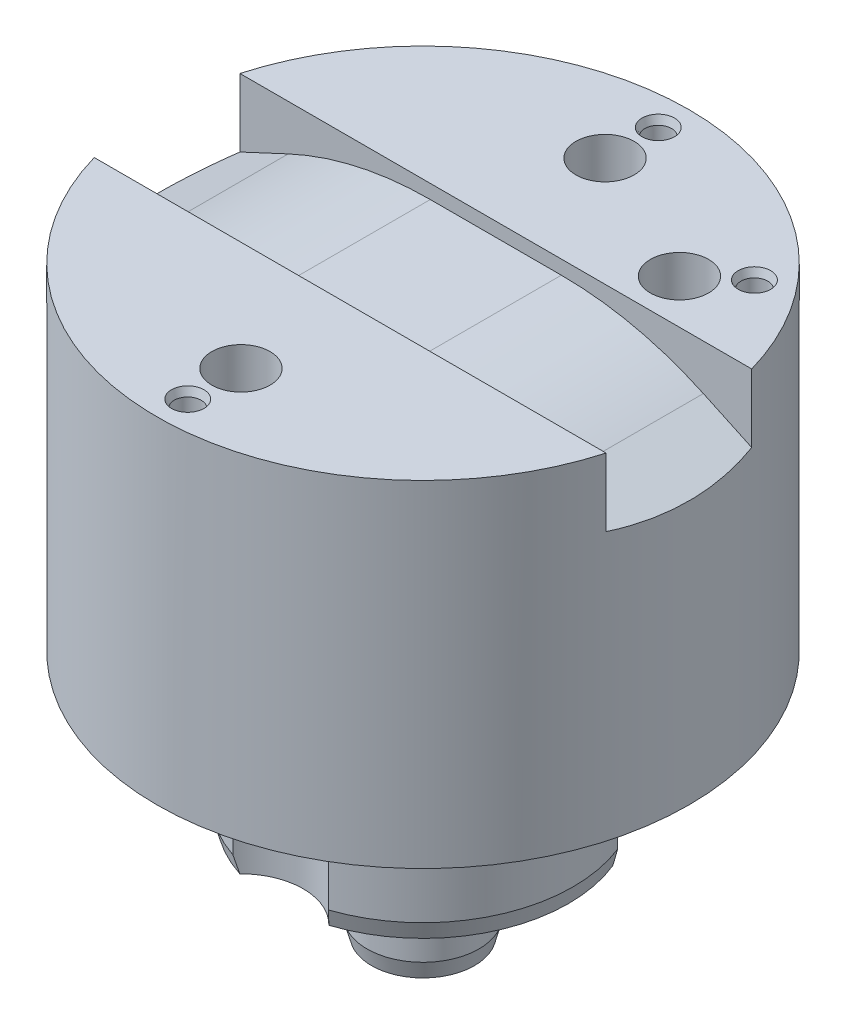
ISO-10303-21;
HEADER;
FILE_DESCRIPTION(('STEP AP214'),'2;1');
FILE_NAME('part.step','',(''),(''),'','','');
FILE_SCHEMA(('AUTOMOTIVE_DESIGN { 1 0 10303 214 1 1 1 1 }'));
ENDSEC;
DATA;
#1=APPLICATION_CONTEXT('core data for automotive mechanical design processes');
#2=APPLICATION_PROTOCOL_DEFINITION('international standard','automotive_design',2000,#1);
#3=PRODUCT_CONTEXT('',#1,'mechanical');
#4=PRODUCT('Part','Part','',(#3));
#5=PRODUCT_RELATED_PRODUCT_CATEGORY('part','',(#4));
#6=PRODUCT_DEFINITION_FORMATION('','',#4);
#7=PRODUCT_DEFINITION_CONTEXT('part definition',#1,'design');
#8=PRODUCT_DEFINITION('design','',#6,#7);
#9=PRODUCT_DEFINITION_SHAPE('','',#8);
#10=(LENGTH_UNIT() NAMED_UNIT(*) SI_UNIT(.MILLI.,.METRE.));
#11=(NAMED_UNIT(*) PLANE_ANGLE_UNIT() SI_UNIT($,.RADIAN.));
#12=(NAMED_UNIT(*) SI_UNIT($,.STERADIAN.) SOLID_ANGLE_UNIT());
#13=UNCERTAINTY_MEASURE_WITH_UNIT(LENGTH_MEASURE(1.E-05),#10,'distance_accuracy_value','');
#14=(GEOMETRIC_REPRESENTATION_CONTEXT(3) GLOBAL_UNCERTAINTY_ASSIGNED_CONTEXT((#13)) GLOBAL_UNIT_ASSIGNED_CONTEXT((#10,
#11,#12)) REPRESENTATION_CONTEXT('',''));
#15=CARTESIAN_POINT('',(0.,0.,0.));
#16=DIRECTION('',(0.,0.,1.));
#17=DIRECTION('',(1.,0.,0.));
#18=AXIS2_PLACEMENT_3D('',#15,#16,#17);
#19=CARTESIAN_POINT('',(23.75,30.,0.));
#20=DIRECTION('',(0.,1.,0.));
#21=DIRECTION('',(0.,0.,1.));
#22=AXIS2_PLACEMENT_3D('',#19,#20,#21);
#23=PLANE('',#22);
#24=CARTESIAN_POINT('',(0.,30.,16.25));
#25=DIRECTION('',(0.,-1.,0.));
#26=DIRECTION('',(0.,0.,-1.));
#27=AXIS2_PLACEMENT_3D('',#24,#25,#26);
#28=CIRCLE('',#27,2.59999999999999);
#29=CARTESIAN_POINT('',(0.,30.,13.65));
#30=VERTEX_POINT('',#29);
#31=EDGE_CURVE('E317',#30,#30,#28,.T.);
#32=ORIENTED_EDGE('',*,*,#31,.T.);
#33=EDGE_LOOP('',(#32));
#34=FACE_BOUND('',#33,.T.);
#35=CARTESIAN_POINT('',(0.,30.,21.));
#36=DIRECTION('',(0.,1.,0.));
#37=DIRECTION('',(0.,0.,1.));
#38=AXIS2_PLACEMENT_3D('',#35,#36,#37);
#39=CIRCLE('',#38,1.45000000000001);
#40=CARTESIAN_POINT('',(0.,30.,22.45));
#41=VERTEX_POINT('',#40);
#42=EDGE_CURVE('E383',#41,#41,#39,.F.);
#43=ORIENTED_EDGE('',*,*,#42,.T.);
#44=EDGE_LOOP('',(#43));
#45=FACE_BOUND('',#44,.T.);
#46=CARTESIAN_POINT('',(0.,30.,0.));
#47=DIRECTION('',(0.,-1.,0.));
#48=DIRECTION('',(0.,0.,-1.));
#49=AXIS2_PLACEMENT_3D('',#46,#47,#48);
#50=CIRCLE('',#49,23.75);
#51=CARTESIAN_POINT('',(22.8432156230247,30.,6.5));
#52=VERTEX_POINT('',#51);
#53=CARTESIAN_POINT('',(-22.8432156230247,30.,6.5));
#54=VERTEX_POINT('',#53);
#55=EDGE_CURVE('E357',#52,#54,#50,.T.);
#56=ORIENTED_EDGE('',*,*,#55,.F.);
#57=DIRECTION('',(-1.,0.,0.));
#58=VECTOR('',#57,1.);
#59=CARTESIAN_POINT('',(-23.75,30.,6.5));
#60=LINE('',#59,#58);
#61=EDGE_CURVE('E163',#52,#54,#60,.T.);
#62=ORIENTED_EDGE('',*,*,#61,.T.);
#63=EDGE_LOOP('',(#56,#62));
#64=FACE_BOUND('',#63,.T.);
#65=ADVANCED_FACE('F35',(#34,#45,#64),#23,.T.);
#66=CARTESIAN_POINT('',(0.,0.,0.));
#67=DIRECTION('',(0.,-1.,0.));
#68=DIRECTION('',(0.,0.,-1.));
#69=AXIS2_PLACEMENT_3D('',#66,#67,#68);
#70=CYLINDRICAL_SURFACE('',#69,23.75);
#71=CARTESIAN_POINT('',(0.,34.5788457269375,0.));
#72=DIRECTION('',(0.422618261740701,-0.906307787036649,0.));
#73=DIRECTION('',(-0.906307787036649,-0.422618261740701,0.));
#74=AXIS2_PLACEMENT_3D('',#71,#72,#73);
#75=ELLIPSE('',#74,26.2052255753592,23.75);
#76=CARTESIAN_POINT('',(-22.8432156230247,23.9268793450351,-6.5));
#77=VERTEX_POINT('',#76);
#78=CARTESIAN_POINT('',(-22.8432156230247,23.9268793450351,6.5));
#79=VERTEX_POINT('',#78);
#80=EDGE_CURVE('E173',#77,#79,#75,.F.);
#81=ORIENTED_EDGE('',*,*,#80,.F.);
#82=DIRECTION('',(0.,-1.,0.));
#83=VECTOR('',#82,1.);
#84=CARTESIAN_POINT('',(-22.8432156230247,0.,-6.5));
#85=LINE('',#84,#83);
#86=CARTESIAN_POINT('',(-22.8432156230247,30.,-6.5));
#87=VERTEX_POINT('',#86);
#88=EDGE_CURVE('E180',#87,#77,#85,.T.);
#89=ORIENTED_EDGE('',*,*,#88,.F.);
#90=CARTESIAN_POINT('',(22.8432156230247,30.,-6.5));
#91=VERTEX_POINT('',#90);
#92=EDGE_CURVE('E355',#87,#91,#50,.T.);
#93=ORIENTED_EDGE('',*,*,#92,.T.);
#94=DIRECTION('',(0.,-1.,0.));
#95=VECTOR('',#94,1.);
#96=CARTESIAN_POINT('',(22.8432156230247,0.,-6.5));
#97=LINE('',#96,#95);
#98=CARTESIAN_POINT('',(22.8432156230247,23.9268793450351,-6.5));
#99=VERTEX_POINT('',#98);
#100=EDGE_CURVE('E178',#99,#91,#97,.F.);
#101=ORIENTED_EDGE('',*,*,#100,.F.);
#102=CARTESIAN_POINT('',(0.,34.5788457269375,0.));
#103=DIRECTION('',(-0.422618261740701,-0.906307787036649,0.));
#104=DIRECTION('',(0.906307787036649,-0.422618261740701,0.));
#105=AXIS2_PLACEMENT_3D('',#102,#103,#104);
#106=ELLIPSE('',#105,26.2052255753592,23.75);
#107=CARTESIAN_POINT('',(22.8432156230247,23.9268793450351,6.5));
#108=VERTEX_POINT('',#107);
#109=EDGE_CURVE('E159',#108,#99,#106,.F.);
#110=ORIENTED_EDGE('',*,*,#109,.F.);
#111=DIRECTION('',(0.,-1.,0.));
#112=VECTOR('',#111,1.);
#113=CARTESIAN_POINT('',(22.8432156230247,0.,6.5));
#114=LINE('',#113,#112);
#115=EDGE_CURVE('E167',#108,#52,#114,.F.);
#116=ORIENTED_EDGE('',*,*,#115,.T.);
#117=ORIENTED_EDGE('',*,*,#55,.T.);
#118=DIRECTION('',(0.,-1.,0.));
#119=VECTOR('',#118,1.);
#120=CARTESIAN_POINT('',(-22.8432156230247,0.,6.5));
#121=LINE('',#120,#119);
#122=EDGE_CURVE('E392',#54,#79,#121,.T.);
#123=ORIENTED_EDGE('',*,*,#122,.T.);
#124=EDGE_LOOP('',(#81,#89,#93,#101,#110,#116,#117,#123));
#125=FACE_BOUND('',#124,.T.);
#126=CARTESIAN_POINT('',(0.,0.,0.));
#127=DIRECTION('',(0.,-1.,0.));
#128=DIRECTION('',(0.,0.,-1.));
#129=AXIS2_PLACEMENT_3D('',#126,#127,#128);
#130=CIRCLE('',#129,23.75);
#131=CARTESIAN_POINT('',(0.,0.,-23.75));
#132=VERTEX_POINT('',#131);
#133=EDGE_CURVE('E352',#132,#132,#130,.T.);
#134=ORIENTED_EDGE('',*,*,#133,.F.);
#135=EDGE_LOOP('',(#134));
#136=FACE_BOUND('',#135,.T.);
#137=ADVANCED_FACE('F175',(#125,#136),#70,.T.);
#138=CARTESIAN_POINT('',(0.,0.,0.));
#139=DIRECTION('',(0.,-1.,0.));
#140=DIRECTION('',(0.,0.,-1.));
#141=AXIS2_PLACEMENT_3D('',#138,#139,#140);
#142=CYLINDRICAL_SURFACE('',#141,13.4);
#143=CARTESIAN_POINT('',(0.,-11.5071796769724,0.));
#144=DIRECTION('',(0.,-1.,0.));
#145=DIRECTION('',(0.,0.,-1.));
#146=AXIS2_PLACEMENT_3D('',#143,#144,#145);
#147=CIRCLE('',#146,13.4);
#148=CARTESIAN_POINT('',(-4.26793716784104,-11.5071796769724,-12.7021538461538));
#149=VERTEX_POINT('',#148);
#150=CARTESIAN_POINT('',(-4.26793716784104,-11.5071796769724,12.7021538461539));
#151=VERTEX_POINT('',#150);
#152=EDGE_CURVE('E370',#149,#151,#147,.F.);
#153=ORIENTED_EDGE('',*,*,#152,.T.);
#154=DIRECTION('',(0.,1.,0.));
#155=VECTOR('',#154,1.);
#156=CARTESIAN_POINT('',(-4.26793716784104,-11.,12.7021538461538));
#157=LINE('',#156,#155);
#158=CARTESIAN_POINT('',(-4.26793716784104,0.,12.7021538461538));
#159=VERTEX_POINT('',#158);
#160=EDGE_CURVE('E261',#151,#159,#157,.T.);
#161=ORIENTED_EDGE('',*,*,#160,.T.);
#162=CARTESIAN_POINT('',(0.,0.,0.));
#163=DIRECTION('',(0.,-1.,0.));
#164=DIRECTION('',(0.,0.,-1.));
#165=AXIS2_PLACEMENT_3D('',#162,#163,#164);
#166=CIRCLE('',#165,13.4);
#167=CARTESIAN_POINT('',(-4.26793716784104,0.,-12.7021538461539));
#168=VERTEX_POINT('',#167);
#169=EDGE_CURVE('E348',#159,#168,#166,.T.);
#170=ORIENTED_EDGE('',*,*,#169,.T.);
#171=DIRECTION('',(0.,1.,0.));
#172=VECTOR('',#171,1.);
#173=CARTESIAN_POINT('',(-4.26793716784104,-11.,-12.7021538461538));
#174=LINE('',#173,#172);
#175=EDGE_CURVE('E283',#168,#149,#174,.F.);
#176=ORIENTED_EDGE('',*,*,#175,.T.);
#177=EDGE_LOOP('',(#153,#161,#170,#176));
#178=FACE_BOUND('',#177,.T.);
#179=ADVANCED_FACE('F405',(#178),#142,.T.);
#180=CARTESIAN_POINT('',(12.4737914998974,0.,-4.89535755763431));
#181=VERTEX_POINT('',#180);
#182=CARTESIAN_POINT('',(4.26793716784104,0.,12.7021538461538));
#183=VERTEX_POINT('',#182);
#184=EDGE_CURVE('E351',#181,#183,#166,.T.);
#185=ORIENTED_EDGE('',*,*,#184,.T.);
#186=DIRECTION('',(0.,1.,0.));
#187=VECTOR('',#186,1.);
#188=CARTESIAN_POINT('',(4.26793716784104,-11.,12.7021538461538));
#189=LINE('',#188,#187);
#190=CARTESIAN_POINT('',(4.26793716784104,-11.5071796769724,12.7021538461538));
#191=VERTEX_POINT('',#190);
#192=EDGE_CURVE('E260',#183,#191,#189,.F.);
#193=ORIENTED_EDGE('',*,*,#192,.T.);
#194=CARTESIAN_POINT('',(12.4737914998974,-11.5071796769724,-4.89535755763431));
#195=VERTEX_POINT('',#194);
#196=EDGE_CURVE('E374',#191,#195,#147,.F.);
#197=ORIENTED_EDGE('',*,*,#196,.T.);
#198=DIRECTION('',(0.,1.,0.));
#199=VECTOR('',#198,1.);
#200=CARTESIAN_POINT('',(12.4737914998974,-11.,-4.89535755763431));
#201=LINE('',#200,#199);
#202=EDGE_CURVE('E296',#195,#181,#201,.T.);
#203=ORIENTED_EDGE('',*,*,#202,.T.);
#204=EDGE_LOOP('',(#185,#193,#197,#203));
#205=FACE_BOUND('',#204,.T.);
#206=ADVANCED_FACE('F473',(#205),#142,.T.);
#207=CARTESIAN_POINT('',(4.26793716784104,0.,-12.7021538461538));
#208=VERTEX_POINT('',#207);
#209=CARTESIAN_POINT('',(6.98703723907965,0.,-11.4342166596455));
#210=VERTEX_POINT('',#209);
#211=EDGE_CURVE('E347',#208,#210,#166,.T.);
#212=ORIENTED_EDGE('',*,*,#211,.T.);
#213=DIRECTION('',(0.,1.,0.));
#214=VECTOR('',#213,1.);
#215=CARTESIAN_POINT('',(6.98703723907965,-11.,-11.4342166596455));
#216=LINE('',#215,#214);
#217=CARTESIAN_POINT('',(6.98703723907965,-11.5071796769724,-11.4342166596455));
#218=VERTEX_POINT('',#217);
#219=EDGE_CURVE('E305',#210,#218,#216,.F.);
#220=ORIENTED_EDGE('',*,*,#219,.T.);
#221=CARTESIAN_POINT('',(4.26793716784105,-11.5071796769724,-12.7021538461538));
#222=VERTEX_POINT('',#221);
#223=EDGE_CURVE('E368',#218,#222,#147,.F.);
#224=ORIENTED_EDGE('',*,*,#223,.T.);
#225=DIRECTION('',(0.,1.,0.));
#226=VECTOR('',#225,1.);
#227=CARTESIAN_POINT('',(4.26793716784104,-11.,-12.7021538461538));
#228=LINE('',#227,#226);
#229=EDGE_CURVE('E274',#222,#208,#228,.T.);
#230=ORIENTED_EDGE('',*,*,#229,.T.);
#231=EDGE_LOOP('',(#212,#220,#224,#230));
#232=FACE_BOUND('',#231,.T.);
#233=ADVANCED_FACE('F461',(#232),#142,.T.);
#234=CARTESIAN_POINT('',(0.,-13.,0.));
#235=DIRECTION('',(0.,1.,0.));
#236=DIRECTION('',(0.,0.,1.));
#237=AXIS2_PLACEMENT_3D('',#234,#235,#236);
#238=CONICAL_SURFACE('',#237,13.,0.26179938779915);
#239=ORIENTED_EDGE('',*,*,#196,.F.);
#240=CARTESIAN_POINT('',(4.26797390257829,-11.5069796769724,12.7021980372475));
#241=CARTESIAN_POINT('',(4.24508339815546,-11.6316042545629,12.6746614907038));
#242=CARTESIAN_POINT('',(4.22183616440305,-11.7561881899293,12.6472368756059));
#243=CARTESIAN_POINT('',(4.17460568750106,-12.0052609722505,12.5926140742735));
#244=CARTESIAN_POINT('',(4.15062247248686,-12.1297498226542,12.5654158794337));
#245=CARTESIAN_POINT('',(4.10189572201431,-12.3786282303866,12.5112463639078));
#246=CARTESIAN_POINT('',(4.07715218605884,-12.5030177876502,12.4842750433702));
#247=CARTESIAN_POINT('',(4.02687601684089,-12.7516916663727,12.430560034923));
#248=CARTESIAN_POINT('',(4.00134335348377,-12.8759759836317,12.4038163557447));
#249=CARTESIAN_POINT('',(3.97540267373374,-13.0002,12.3771878974483));
#250=B_SPLINE_CURVE_WITH_KNOTS('',3,(#240,#241,#242,#243,#244,#245,#246,#247,#248,#249),
.UNSPECIFIED.,.F.,.F.,(4,2,2,2,4),(0.,0.389000554577273,0.777986256768243,1.166972213297,
1.55597302277849),.UNSPECIFIED.);
#251=CARTESIAN_POINT('',(3.97544443870204,-13.,12.3772307692308));
#252=VERTEX_POINT('',#251);
#253=EDGE_CURVE('E253',#191,#252,#250,.T.);
#254=ORIENTED_EDGE('',*,*,#253,.T.);
#255=CARTESIAN_POINT('',(0.,-13.,0.));
#256=DIRECTION('',(0.,-1.,0.));
#257=DIRECTION('',(0.,0.,-1.));
#258=AXIS2_PLACEMENT_3D('',#255,#256,#257);
#259=CIRCLE('',#258,13.);
#260=CARTESIAN_POINT('',(12.0368752801654,-13.,-4.91056345949656));
#261=VERTEX_POINT('',#260);
#262=EDGE_CURVE('E369',#261,#252,#259,.T.);
#263=ORIENTED_EDGE('',*,*,#262,.F.);
#264=CARTESIAN_POINT('',(12.0368155924706,-13.0001999999999,-4.9105678958679));
#265=CARTESIAN_POINT('',(12.0738885225075,-12.8759759836316,-4.9078126253526));
#266=CARTESIAN_POINT('',(12.1107874489789,-12.7516916663726,-4.90544397608309));
#267=CARTESIAN_POINT('',(12.1842524313477,-12.5030177876502,-4.90145753791643));
#268=CARTESIAN_POINT('',(12.2208184999012,-12.3786282303865,-4.89983972035313));
#269=CARTESIAN_POINT('',(12.2936357077202,-12.1297498226542,-4.89733235732513));
#270=CARTESIAN_POINT('',(12.3298868471917,-12.0052609722505,-4.89644281138425));
#271=CARTESIAN_POINT('',(12.4020895059722,-11.7561881899293,-4.89537302691047));
#272=CARTESIAN_POINT('',(12.4380410137881,-11.6316042545629,-4.89519281546188));
#273=CARTESIAN_POINT('',(12.4738489648731,-11.5069796769724,-4.89535782268042));
#274=B_SPLINE_CURVE_WITH_KNOTS('',3,(#264,#265,#266,#267,#268,#269,#270,#271,#272,#273),
.UNSPECIFIED.,.F.,.F.,(4,2,2,2,4),(0.,0.389000809481457,0.777986766010179,1.16697246820112,
1.55597302277836),.UNSPECIFIED.);
#275=EDGE_CURVE('E286',#261,#195,#274,.T.);
#276=ORIENTED_EDGE('',*,*,#275,.T.);
#277=EDGE_LOOP('',(#239,#254,#263,#276));
#278=FACE_BOUND('',#277,.T.);
#279=ADVANCED_FACE('F240',(#278),#238,.T.);
#280=CARTESIAN_POINT('',(-3.97544443870204,-13.,12.3772307692308));
#281=VERTEX_POINT('',#280);
#282=CARTESIAN_POINT('',(-3.97544443870204,-13.,-12.3772307692308));
#283=VERTEX_POINT('',#282);
#284=EDGE_CURVE('E364',#281,#283,#259,.T.);
#285=ORIENTED_EDGE('',*,*,#284,.F.);
#286=CARTESIAN_POINT('',(-3.97540267373374,-13.0002,12.3771878974483));
#287=CARTESIAN_POINT('',(-4.00134335348377,-12.8759759836317,12.4038163557447));
#288=CARTESIAN_POINT('',(-4.02687601684089,-12.7516916663727,12.430560034923));
#289=CARTESIAN_POINT('',(-4.07715218605884,-12.5030177876502,12.4842750433702));
#290=CARTESIAN_POINT('',(-4.10189572201431,-12.3786282303866,12.5112463639078));
#291=CARTESIAN_POINT('',(-4.15062247248686,-12.1297498226542,12.5654158794337));
#292=CARTESIAN_POINT('',(-4.17460568750106,-12.0052609722505,12.5926140742735));
#293=CARTESIAN_POINT('',(-4.22183616440305,-11.7561881899293,12.6472368756059));
#294=CARTESIAN_POINT('',(-4.24508339815545,-11.6316042545629,12.6746614907038));
#295=CARTESIAN_POINT('',(-4.26797390257829,-11.5069796769724,12.7021980372475));
#296=B_SPLINE_CURVE_WITH_KNOTS('',3,(#286,#287,#288,#289,#290,#291,#292,#293,#294,#295),
.UNSPECIFIED.,.F.,.F.,(4,2,2,2,4),(0.,0.389000809481489,0.777986766010243,1.16697246820122,
1.55597302277849),.UNSPECIFIED.);
#297=EDGE_CURVE('E228',#281,#151,#296,.T.);
#298=ORIENTED_EDGE('',*,*,#297,.T.);
#299=ORIENTED_EDGE('',*,*,#152,.F.);
#300=CARTESIAN_POINT('',(-4.26797390257829,-11.5069796769724,-12.7021980372475));
#301=CARTESIAN_POINT('',(-4.24508339815546,-11.6316042545629,-12.6746614907038));
#302=CARTESIAN_POINT('',(-4.22183616440305,-11.7561881899293,-12.6472368756059));
#303=CARTESIAN_POINT('',(-4.17460568750106,-12.0052609722505,-12.5926140742735));
#304=CARTESIAN_POINT('',(-4.15062247248686,-12.1297498226542,-12.5654158794337));
#305=CARTESIAN_POINT('',(-4.10189572201431,-12.3786282303866,-12.5112463639078));
#306=CARTESIAN_POINT('',(-4.07715218605884,-12.5030177876502,-12.4842750433702));
#307=CARTESIAN_POINT('',(-4.02687601684089,-12.7516916663727,-12.430560034923));
#308=CARTESIAN_POINT('',(-4.00134335348377,-12.8759759836317,-12.4038163557447));
#309=CARTESIAN_POINT('',(-3.97540267373374,-13.0002,-12.3771878974483));
#310=B_SPLINE_CURVE_WITH_KNOTS('',3,(#300,#301,#302,#303,#304,#305,#306,#307,#308,#309),
.UNSPECIFIED.,.F.,.F.,(4,2,2,2,4),(0.,0.389000554577273,0.777986256768243,1.166972213297,
1.55597302277849),.UNSPECIFIED.);
#311=EDGE_CURVE('E276',#149,#283,#310,.T.);
#312=ORIENTED_EDGE('',*,*,#311,.T.);
#313=EDGE_LOOP('',(#285,#298,#299,#312));
#314=FACE_BOUND('',#313,.T.);
#315=ADVANCED_FACE('F485',(#314),#238,.T.);
#316=ORIENTED_EDGE('',*,*,#223,.F.);
#317=CARTESIAN_POINT('',(6.98704747878742,-11.5069796769724,-11.4342732055743));
#318=CARTESIAN_POINT('',(6.9806669929474,-11.6316042545629,-11.3990379109291));
#319=CARTESIAN_POINT('',(6.97460155276254,-11.7561881899293,-11.3636012939099));
#320=CARTESIAN_POINT('',(6.96311722468644,-12.0052609722505,-11.2923097896304));
#321=CARTESIAN_POINT('',(6.9576983121181,-12.1297498226542,-11.2564549183918));
#322=CARTESIAN_POINT('',(6.94752300722712,-12.3786282303866,-11.1843085685583));
#323=CARTESIAN_POINT('',(6.94276661533766,-12.5030177876502,-11.148017089678));
#324=CARTESIAN_POINT('',(6.93393543024041,-12.7516916663727,-11.0749759677432));
#325=CARTESIAN_POINT('',(6.92986066306557,-12.8759759836317,-11.0382263072472));
#326=CARTESIAN_POINT('',(6.926136428089,-13.0002,-11.001238150616));
#327=B_SPLINE_CURVE_WITH_KNOTS('',3,(#317,#318,#319,#320,#321,#322,#323,#324,#325,#326),
.UNSPECIFIED.,.F.,.F.,(4,2,2,2,4),(0.,0.389000554577274,0.777986256768244,1.166972213297,
1.55597302277849),.UNSPECIFIED.);
#328=CARTESIAN_POINT('',(6.92614242377555,-13.,-11.0012977018885));
#329=VERTEX_POINT('',#328);
#330=EDGE_CURVE('E298',#218,#329,#327,.T.);
#331=ORIENTED_EDGE('',*,*,#330,.T.);
#332=CARTESIAN_POINT('',(3.97544443870205,-13.,-12.3772307692308));
#333=VERTEX_POINT('',#332);
#334=EDGE_CURVE('E365',#333,#329,#259,.T.);
#335=ORIENTED_EDGE('',*,*,#334,.F.);
#336=CARTESIAN_POINT('',(3.97540267373374,-13.0002,-12.3771878974483));
#337=CARTESIAN_POINT('',(4.00134335348378,-12.8759759836317,-12.4038163557447));
#338=CARTESIAN_POINT('',(4.0268760168409,-12.7516916663727,-12.430560034923));
#339=CARTESIAN_POINT('',(4.07715218605885,-12.5030177876502,-12.4842750433702));
#340=CARTESIAN_POINT('',(4.10189572201431,-12.3786282303866,-12.5112463639078));
#341=CARTESIAN_POINT('',(4.15062247248686,-12.1297498226542,-12.5654158794337));
#342=CARTESIAN_POINT('',(4.17460568750106,-12.0052609722505,-12.5926140742735));
#343=CARTESIAN_POINT('',(4.22183616440305,-11.7561881899293,-12.6472368756059));
#344=CARTESIAN_POINT('',(4.24508339815546,-11.6316042545629,-12.6746614907038));
#345=CARTESIAN_POINT('',(4.2679739025783,-11.5069796769724,-12.7021980372475));
#346=B_SPLINE_CURVE_WITH_KNOTS('',3,(#336,#337,#338,#339,#340,#341,#342,#343,#344,#345),
.UNSPECIFIED.,.F.,.F.,(4,2,2,2,4),(0.,0.389000809481488,0.777986766010245,1.16697246820121,
1.55597302277849),.UNSPECIFIED.);
#347=EDGE_CURVE('E264',#333,#222,#346,.T.);
#348=ORIENTED_EDGE('',*,*,#347,.T.);
#349=EDGE_LOOP('',(#316,#331,#335,#348));
#350=FACE_BOUND('',#349,.T.);
#351=ADVANCED_FACE('F420',(#350),#238,.T.);
#352=CARTESIAN_POINT('',(5.,-22.,0.));
#353=DIRECTION('',(0.,-1.,0.));
#354=DIRECTION('',(0.,0.,-1.));
#355=AXIS2_PLACEMENT_3D('',#352,#353,#354);
#356=PLANE('',#355);
#357=CARTESIAN_POINT('',(0.,-22.,0.));
#358=DIRECTION('',(0.,-1.,0.));
#359=DIRECTION('',(0.,0.,-1.));
#360=AXIS2_PLACEMENT_3D('',#357,#358,#359);
#361=CIRCLE('',#360,4.60000000000002);
#362=CARTESIAN_POINT('',(0.,-22.,-4.60000000000002));
#363=VERTEX_POINT('',#362);
#364=EDGE_CURVE('E358',#363,#363,#361,.T.);
#365=ORIENTED_EDGE('',*,*,#364,.T.);
#366=EDGE_LOOP('',(#365));
#367=FACE_BOUND('',#366,.T.);
#368=ADVANCED_FACE('F411',(#367),#356,.T.);
#369=DIRECTION('',(-1.,0.,0.));
#370=VECTOR('',#369,1.);
#371=CARTESIAN_POINT('',(-23.75,30.,-6.5));
#372=LINE('',#371,#370);
#373=EDGE_CURVE('E205',#91,#87,#372,.T.);
#374=ORIENTED_EDGE('',*,*,#373,.F.);
#375=ORIENTED_EDGE('',*,*,#92,.F.);
#376=EDGE_LOOP('',(#374,#375));
#377=FACE_BOUND('',#376,.T.);
#378=CARTESIAN_POINT('',(16.0869333054986,30.,-13.4985398034173));
#379=DIRECTION('',(0.,1.,0.));
#380=DIRECTION('',(0.,0.,1.));
#381=AXIS2_PLACEMENT_3D('',#378,#379,#380);
#382=CIRCLE('',#381,1.45000000000001);
#383=CARTESIAN_POINT('',(16.0869333054986,30.,-12.0485398034173));
#384=VERTEX_POINT('',#383);
#385=EDGE_CURVE('E380',#384,#384,#382,.F.);
#386=ORIENTED_EDGE('',*,*,#385,.T.);
#387=EDGE_LOOP('',(#386));
#388=FACE_BOUND('',#387,.T.);
#389=CARTESIAN_POINT('',(0.,30.,-21.));
#390=DIRECTION('',(0.,1.,0.));
#391=DIRECTION('',(0.,0.,1.));
#392=AXIS2_PLACEMENT_3D('',#389,#390,#391);
#393=CIRCLE('',#392,1.45000000000001);
#394=CARTESIAN_POINT('',(0.,30.,-19.55));
#395=VERTEX_POINT('',#394);
#396=EDGE_CURVE('E377',#395,#395,#393,.F.);
#397=ORIENTED_EDGE('',*,*,#396,.T.);
#398=EDGE_LOOP('',(#397));
#399=FACE_BOUND('',#398,.T.);
#400=CARTESIAN_POINT('',(0.,30.,-16.25));
#401=DIRECTION('',(0.,-1.,0.));
#402=DIRECTION('',(0.,0.,-1.));
#403=AXIS2_PLACEMENT_3D('',#400,#401,#402);
#404=CIRCLE('',#403,2.59999999999999);
#405=CARTESIAN_POINT('',(0.,30.,-18.85));
#406=VERTEX_POINT('',#405);
#407=EDGE_CURVE('E329',#406,#406,#404,.T.);
#408=ORIENTED_EDGE('',*,*,#407,.T.);
#409=EDGE_LOOP('',(#408));
#410=FACE_BOUND('',#409,.T.);
#411=CARTESIAN_POINT('',(12.4482222006834,30.,-10.4452986574062));
#412=DIRECTION('',(0.,-1.,0.));
#413=DIRECTION('',(0.,0.,-1.));
#414=AXIS2_PLACEMENT_3D('',#411,#412,#413);
#415=CIRCLE('',#414,2.59999999999999);
#416=CARTESIAN_POINT('',(12.4482222006834,30.,-13.0452986574062));
#417=VERTEX_POINT('',#416);
#418=EDGE_CURVE('E341',#417,#417,#415,.T.);
#419=ORIENTED_EDGE('',*,*,#418,.T.);
#420=EDGE_LOOP('',(#419));
#421=FACE_BOUND('',#420,.T.);
#422=ADVANCED_FACE('F401',(#377,#388,#399,#410,#421),#23,.T.);
#423=CARTESIAN_POINT('',(13.4,0.,0.));
#424=DIRECTION('',(0.,-1.,0.));
#425=DIRECTION('',(0.,0.,-1.));
#426=AXIS2_PLACEMENT_3D('',#423,#424,#425);
#427=PLANE('',#426);
#428=CARTESIAN_POINT('',(0.,0.,16.25));
#429=DIRECTION('',(0.,-1.,0.));
#430=DIRECTION('',(0.,0.,-1.));
#431=AXIS2_PLACEMENT_3D('',#428,#429,#430);
#432=CIRCLE('',#431,5.55);
#433=EDGE_CURVE('E308',#183,#159,#432,.T.);
#434=ORIENTED_EDGE('',*,*,#433,.F.);
#435=ORIENTED_EDGE('',*,*,#184,.F.);
#436=CARTESIAN_POINT('',(12.4482222006834,0.,-10.4452986574062));
#437=DIRECTION('',(0.,-1.,0.));
#438=DIRECTION('',(0.,0.,-1.));
#439=AXIS2_PLACEMENT_3D('',#436,#437,#438);
#440=CIRCLE('',#439,5.55);
#441=EDGE_CURVE('E332',#210,#181,#440,.T.);
#442=ORIENTED_EDGE('',*,*,#441,.F.);
#443=ORIENTED_EDGE('',*,*,#211,.F.);
#444=CARTESIAN_POINT('',(0.,0.,-16.25));
#445=DIRECTION('',(0.,-1.,0.));
#446=DIRECTION('',(0.,0.,-1.));
#447=AXIS2_PLACEMENT_3D('',#444,#445,#446);
#448=CIRCLE('',#447,5.55);
#449=EDGE_CURVE('E320',#168,#208,#448,.T.);
#450=ORIENTED_EDGE('',*,*,#449,.F.);
#451=ORIENTED_EDGE('',*,*,#169,.F.);
#452=EDGE_LOOP('',(#434,#435,#442,#443,#450,#451));
#453=FACE_BOUND('',#452,.T.);
#454=ORIENTED_EDGE('',*,*,#133,.T.);
#455=EDGE_LOOP('',(#454));
#456=FACE_BOUND('',#455,.T.);
#457=ADVANCED_FACE('F410',(#453,#456),#427,.T.);
#458=CARTESIAN_POINT('',(5.,-13.,0.));
#459=DIRECTION('',(0.,-1.,0.));
#460=DIRECTION('',(0.,0.,-1.));
#461=AXIS2_PLACEMENT_3D('',#458,#459,#460);
#462=PLANE('',#461);
#463=ORIENTED_EDGE('',*,*,#262,.T.);
#464=CARTESIAN_POINT('',(0.,-13.,16.25));
#465=DIRECTION('',(0.,-1.,0.));
#466=DIRECTION('',(0.,0.,-1.));
#467=AXIS2_PLACEMENT_3D('',#464,#465,#466);
#468=CIRCLE('',#467,5.55);
#469=EDGE_CURVE('E237',#252,#281,#468,.F.);
#470=ORIENTED_EDGE('',*,*,#469,.T.);
#471=ORIENTED_EDGE('',*,*,#284,.T.);
#472=CARTESIAN_POINT('',(0.,-13.,-16.25));
#473=DIRECTION('',(0.,-1.,0.));
#474=DIRECTION('',(0.,0.,-1.));
#475=AXIS2_PLACEMENT_3D('',#472,#473,#474);
#476=CIRCLE('',#475,5.55);
#477=EDGE_CURVE('E271',#283,#333,#476,.F.);
#478=ORIENTED_EDGE('',*,*,#477,.T.);
#479=ORIENTED_EDGE('',*,*,#334,.T.);
#480=CARTESIAN_POINT('',(12.4482222006834,-13.,-10.4452986574062));
#481=DIRECTION('',(0.,-1.,0.));
#482=DIRECTION('',(0.,0.,-1.));
#483=AXIS2_PLACEMENT_3D('',#480,#481,#482);
#484=CIRCLE('',#483,5.55);
#485=EDGE_CURVE('E293',#329,#261,#484,.F.);
#486=ORIENTED_EDGE('',*,*,#485,.T.);
#487=EDGE_LOOP('',(#463,#470,#471,#478,#479,#486));
#488=FACE_BOUND('',#487,.T.);
#489=CARTESIAN_POINT('',(0.,-13.,0.));
#490=DIRECTION('',(0.,-1.,0.));
#491=DIRECTION('',(0.,0.,-1.));
#492=AXIS2_PLACEMENT_3D('',#489,#490,#491);
#493=CIRCLE('',#492,5.);
#494=CARTESIAN_POINT('',(0.,-13.,-5.));
#495=VERTEX_POINT('',#494);
#496=EDGE_CURVE('E344',#495,#495,#493,.T.);
#497=ORIENTED_EDGE('',*,*,#496,.F.);
#498=EDGE_LOOP('',(#497));
#499=FACE_BOUND('',#498,.T.);
#500=ADVANCED_FACE('F417',(#488,#499),#462,.T.);
#501=CARTESIAN_POINT('',(0.,0.,0.));
#502=DIRECTION('',(0.,-1.,0.));
#503=DIRECTION('',(0.,0.,-1.));
#504=AXIS2_PLACEMENT_3D('',#501,#502,#503);
#505=CYLINDRICAL_SURFACE('',#504,5.);
#506=CARTESIAN_POINT('',(0.,-20.5071796769725,0.));
#507=DIRECTION('',(0.,-1.,0.));
#508=DIRECTION('',(0.,0.,-1.));
#509=AXIS2_PLACEMENT_3D('',#506,#507,#508);
#510=CIRCLE('',#509,5.);
#511=CARTESIAN_POINT('',(0.,-20.5071796769725,-5.));
#512=VERTEX_POINT('',#511);
#513=EDGE_CURVE('E361',#512,#512,#510,.F.);
#514=ORIENTED_EDGE('',*,*,#513,.T.);
#515=EDGE_LOOP('',(#514));
#516=FACE_BOUND('',#515,.T.);
#517=ORIENTED_EDGE('',*,*,#496,.T.);
#518=EDGE_LOOP('',(#517));
#519=FACE_BOUND('',#518,.T.);
#520=ADVANCED_FACE('F544',(#516,#519),#505,.T.);
#521=CARTESIAN_POINT('',(0.,-22.,0.));
#522=DIRECTION('',(0.,1.,0.));
#523=DIRECTION('',(0.,0.,1.));
#524=AXIS2_PLACEMENT_3D('',#521,#522,#523);
#525=CONICAL_SURFACE('',#524,4.60000000000002,0.261799387799148);
#526=ORIENTED_EDGE('',*,*,#513,.F.);
#527=EDGE_LOOP('',(#526));
#528=FACE_BOUND('',#527,.T.);
#529=ORIENTED_EDGE('',*,*,#364,.F.);
#530=EDGE_LOOP('',(#529));
#531=FACE_BOUND('',#530,.T.);
#532=ADVANCED_FACE('F437',(#528,#531),#525,.T.);
#533=CARTESIAN_POINT('',(12.4482222006834,0.,-10.4452986574062));
#534=DIRECTION('',(0.,-1.,0.));
#535=DIRECTION('',(0.,0.,-1.));
#536=AXIS2_PLACEMENT_3D('',#533,#534,#535);
#537=CYLINDRICAL_SURFACE('',#536,2.59999999999999);
#538=ORIENTED_EDGE('',*,*,#418,.F.);
#539=EDGE_LOOP('',(#538));
#540=FACE_BOUND('',#539,.T.);
#541=CARTESIAN_POINT('',(12.4482222006834,24.,-10.4452986574062));
#542=DIRECTION('',(0.,-1.,0.));
#543=DIRECTION('',(0.,0.,-1.));
#544=AXIS2_PLACEMENT_3D('',#541,#542,#543);
#545=CIRCLE('',#544,2.59999999999999);
#546=CARTESIAN_POINT('',(12.4482222006834,24.,-13.0452986574062));
#547=VERTEX_POINT('',#546);
#548=EDGE_CURVE('E338',#547,#547,#545,.T.);
#549=ORIENTED_EDGE('',*,*,#548,.T.);
#550=EDGE_LOOP('',(#549));
#551=FACE_BOUND('',#550,.T.);
#552=ADVANCED_FACE('F433',(#540,#551),#537,.F.);
#553=CARTESIAN_POINT('',(15.0482222006834,24.,-10.4452986574062));
#554=DIRECTION('',(0.,1.,0.));
#555=DIRECTION('',(0.,0.,1.));
#556=AXIS2_PLACEMENT_3D('',#553,#554,#555);
#557=PLANE('',#556);
#558=ORIENTED_EDGE('',*,*,#548,.F.);
#559=EDGE_LOOP('',(#558));
#560=FACE_BOUND('',#559,.T.);
#561=CARTESIAN_POINT('',(12.4482222006834,24.,-10.4452986574062));
#562=DIRECTION('',(0.,-1.,0.));
#563=DIRECTION('',(0.,0.,-1.));
#564=AXIS2_PLACEMENT_3D('',#561,#562,#563);
#565=CIRCLE('',#564,5.55);
#566=CARTESIAN_POINT('',(12.4482222006834,24.,-15.9952986574062));
#567=VERTEX_POINT('',#566);
#568=EDGE_CURVE('E335',#567,#567,#565,.T.);
#569=ORIENTED_EDGE('',*,*,#568,.T.);
#570=EDGE_LOOP('',(#569));
#571=FACE_BOUND('',#570,.T.);
#572=ADVANCED_FACE('F436',(#560,#571),#557,.F.);
#573=CARTESIAN_POINT('',(12.4482222006834,0.,-10.4452986574062));
#574=DIRECTION('',(0.,-1.,0.));
#575=DIRECTION('',(0.,0.,-1.));
#576=AXIS2_PLACEMENT_3D('',#573,#574,#575);
#577=CYLINDRICAL_SURFACE('',#576,5.55);
#578=ORIENTED_EDGE('',*,*,#568,.F.);
#579=EDGE_LOOP('',(#578));
#580=FACE_BOUND('',#579,.T.);
#581=ORIENTED_EDGE('',*,*,#441,.T.);
#582=ORIENTED_EDGE('',*,*,#202,.F.);
#583=ORIENTED_EDGE('',*,*,#275,.F.);
#584=ORIENTED_EDGE('',*,*,#485,.F.);
#585=ORIENTED_EDGE('',*,*,#330,.F.);
#586=ORIENTED_EDGE('',*,*,#219,.F.);
#587=EDGE_LOOP('',(#581,#582,#583,#584,#585,#586));
#588=FACE_BOUND('',#587,.T.);
#589=ADVANCED_FACE('F443',(#580,#588),#577,.F.);
#590=CARTESIAN_POINT('',(0.,0.,-16.25));
#591=DIRECTION('',(0.,-1.,0.));
#592=DIRECTION('',(0.,0.,-1.));
#593=AXIS2_PLACEMENT_3D('',#590,#591,#592);
#594=CYLINDRICAL_SURFACE('',#593,2.59999999999999);
#595=ORIENTED_EDGE('',*,*,#407,.F.);
#596=EDGE_LOOP('',(#595));
#597=FACE_BOUND('',#596,.T.);
#598=CARTESIAN_POINT('',(0.,24.,-16.25));
#599=DIRECTION('',(0.,-1.,0.));
#600=DIRECTION('',(0.,0.,-1.));
#601=AXIS2_PLACEMENT_3D('',#598,#599,#600);
#602=CIRCLE('',#601,2.6);
#603=CARTESIAN_POINT('',(0.,24.,-18.85));
#604=VERTEX_POINT('',#603);
#605=EDGE_CURVE('E326',#604,#604,#602,.T.);
#606=ORIENTED_EDGE('',*,*,#605,.T.);
#607=EDGE_LOOP('',(#606));
#608=FACE_BOUND('',#607,.T.);
#609=ADVANCED_FACE('F449',(#597,#608),#594,.F.);
#610=CARTESIAN_POINT('',(2.6,24.,-16.25));
#611=DIRECTION('',(0.,1.,0.));
#612=DIRECTION('',(0.,0.,1.));
#613=AXIS2_PLACEMENT_3D('',#610,#611,#612);
#614=PLANE('',#613);
#615=ORIENTED_EDGE('',*,*,#605,.F.);
#616=EDGE_LOOP('',(#615));
#617=FACE_BOUND('',#616,.T.);
#618=CARTESIAN_POINT('',(0.,24.,-16.25));
#619=DIRECTION('',(0.,-1.,0.));
#620=DIRECTION('',(0.,0.,-1.));
#621=AXIS2_PLACEMENT_3D('',#618,#619,#620);
#622=CIRCLE('',#621,5.55);
#623=CARTESIAN_POINT('',(0.,24.,-21.8));
#624=VERTEX_POINT('',#623);
#625=EDGE_CURVE('E323',#624,#624,#622,.T.);
#626=ORIENTED_EDGE('',*,*,#625,.T.);
#627=EDGE_LOOP('',(#626));
#628=FACE_BOUND('',#627,.T.);
#629=ADVANCED_FACE('F563',(#617,#628),#614,.F.);
#630=CARTESIAN_POINT('',(0.,0.,-16.25));
#631=DIRECTION('',(0.,-1.,0.));
#632=DIRECTION('',(0.,0.,-1.));
#633=AXIS2_PLACEMENT_3D('',#630,#631,#632);
#634=CYLINDRICAL_SURFACE('',#633,5.55);
#635=ORIENTED_EDGE('',*,*,#625,.F.);
#636=EDGE_LOOP('',(#635));
#637=FACE_BOUND('',#636,.T.);
#638=ORIENTED_EDGE('',*,*,#449,.T.);
#639=ORIENTED_EDGE('',*,*,#229,.F.);
#640=ORIENTED_EDGE('',*,*,#347,.F.);
#641=ORIENTED_EDGE('',*,*,#477,.F.);
#642=ORIENTED_EDGE('',*,*,#311,.F.);
#643=ORIENTED_EDGE('',*,*,#175,.F.);
#644=EDGE_LOOP('',(#638,#639,#640,#641,#642,#643));
#645=FACE_BOUND('',#644,.T.);
#646=ADVANCED_FACE('F466',(#637,#645),#634,.F.);
#647=CARTESIAN_POINT('',(0.,0.,16.25));
#648=DIRECTION('',(0.,-1.,0.));
#649=DIRECTION('',(0.,0.,-1.));
#650=AXIS2_PLACEMENT_3D('',#647,#648,#649);
#651=CYLINDRICAL_SURFACE('',#650,2.59999999999999);
#652=ORIENTED_EDGE('',*,*,#31,.F.);
#653=EDGE_LOOP('',(#652));
#654=FACE_BOUND('',#653,.T.);
#655=CARTESIAN_POINT('',(0.,24.,16.25));
#656=DIRECTION('',(0.,-1.,0.));
#657=DIRECTION('',(0.,0.,-1.));
#658=AXIS2_PLACEMENT_3D('',#655,#656,#657);
#659=CIRCLE('',#658,2.6);
#660=CARTESIAN_POINT('',(0.,24.,13.65));
#661=VERTEX_POINT('',#660);
#662=EDGE_CURVE('E314',#661,#661,#659,.T.);
#663=ORIENTED_EDGE('',*,*,#662,.T.);
#664=EDGE_LOOP('',(#663));
#665=FACE_BOUND('',#664,.T.);
#666=ADVANCED_FACE('F562',(#654,#665),#651,.F.);
#667=CARTESIAN_POINT('',(2.6,24.,16.25));
#668=DIRECTION('',(0.,1.,0.));
#669=DIRECTION('',(0.,0.,1.));
#670=AXIS2_PLACEMENT_3D('',#667,#668,#669);
#671=PLANE('',#670);
#672=ORIENTED_EDGE('',*,*,#662,.F.);
#673=EDGE_LOOP('',(#672));
#674=FACE_BOUND('',#673,.T.);
#675=CARTESIAN_POINT('',(0.,24.,16.25));
#676=DIRECTION('',(0.,-1.,0.));
#677=DIRECTION('',(0.,0.,-1.));
#678=AXIS2_PLACEMENT_3D('',#675,#676,#677);
#679=CIRCLE('',#678,5.55);
#680=CARTESIAN_POINT('',(0.,24.,10.7));
#681=VERTEX_POINT('',#680);
#682=EDGE_CURVE('E311',#681,#681,#679,.T.);
#683=ORIENTED_EDGE('',*,*,#682,.T.);
#684=EDGE_LOOP('',(#683));
#685=FACE_BOUND('',#684,.T.);
#686=ADVANCED_FACE('F577',(#674,#685),#671,.F.);
#687=CARTESIAN_POINT('',(0.,0.,16.25));
#688=DIRECTION('',(0.,-1.,0.));
#689=DIRECTION('',(0.,0.,-1.));
#690=AXIS2_PLACEMENT_3D('',#687,#688,#689);
#691=CYLINDRICAL_SURFACE('',#690,5.55);
#692=ORIENTED_EDGE('',*,*,#682,.F.);
#693=EDGE_LOOP('',(#692));
#694=FACE_BOUND('',#693,.T.);
#695=ORIENTED_EDGE('',*,*,#433,.T.);
#696=ORIENTED_EDGE('',*,*,#160,.F.);
#697=ORIENTED_EDGE('',*,*,#297,.F.);
#698=ORIENTED_EDGE('',*,*,#469,.F.);
#699=ORIENTED_EDGE('',*,*,#253,.F.);
#700=ORIENTED_EDGE('',*,*,#192,.F.);
#701=EDGE_LOOP('',(#695,#696,#697,#698,#699,#700));
#702=FACE_BOUND('',#701,.T.);
#703=ADVANCED_FACE('F470',(#694,#702),#691,.F.);
#704=CARTESIAN_POINT('',(0.,28.,21.));
#705=DIRECTION('',(0.,-1.,0.));
#706=DIRECTION('',(0.,0.,-1.));
#707=AXIS2_PLACEMENT_3D('',#704,#705,#706);
#708=PLANE('',#707);
#709=CARTESIAN_POINT('',(0.,28.,21.));
#710=DIRECTION('',(0.,1.,0.));
#711=DIRECTION('',(0.,0.,1.));
#712=AXIS2_PLACEMENT_3D('',#709,#710,#711);
#713=CIRCLE('',#712,1.2);
#714=CARTESIAN_POINT('',(0.,28.,22.2));
#715=VERTEX_POINT('',#714);
#716=EDGE_CURVE('E225',#715,#715,#713,.T.);
#717=ORIENTED_EDGE('',*,*,#716,.T.);
#718=EDGE_LOOP('',(#717));
#719=FACE_BOUND('',#718,.T.);
#720=ADVANCED_FACE('F576',(#719),#708,.F.);
#721=CARTESIAN_POINT('',(0.,30.,21.));
#722=DIRECTION('',(0.,1.,0.));
#723=DIRECTION('',(0.,0.,1.));
#724=AXIS2_PLACEMENT_3D('',#721,#722,#723);
#725=CYLINDRICAL_SURFACE('',#724,1.2);
#726=CARTESIAN_POINT('',(0.,29.3131306451363,21.));
#727=DIRECTION('',(0.,1.,0.));
#728=DIRECTION('',(0.,0.,1.));
#729=AXIS2_PLACEMENT_3D('',#726,#727,#728);
#730=CIRCLE('',#729,1.2);
#731=CARTESIAN_POINT('',(0.,29.3131306451363,22.2));
#732=VERTEX_POINT('',#731);
#733=EDGE_CURVE('E373',#732,#732,#730,.T.);
#734=ORIENTED_EDGE('',*,*,#733,.T.);
#735=EDGE_LOOP('',(#734));
#736=FACE_BOUND('',#735,.T.);
#737=ORIENTED_EDGE('',*,*,#716,.F.);
#738=EDGE_LOOP('',(#737));
#739=FACE_BOUND('',#738,.T.);
#740=ADVANCED_FACE('F587',(#736,#739),#725,.F.);
#741=CARTESIAN_POINT('',(16.0869333054986,28.,-13.4985398034173));
#742=DIRECTION('',(0.,-1.,0.));
#743=DIRECTION('',(0.,0.,-1.));
#744=AXIS2_PLACEMENT_3D('',#741,#742,#743);
#745=PLANE('',#744);
#746=CARTESIAN_POINT('',(16.0869333054986,28.,-13.4985398034173));
#747=DIRECTION('',(0.,1.,0.));
#748=DIRECTION('',(0.,0.,1.));
#749=AXIS2_PLACEMENT_3D('',#746,#747,#748);
#750=CIRCLE('',#749,1.2);
#751=CARTESIAN_POINT('',(16.0869333054986,28.,-12.2985398034173));
#752=VERTEX_POINT('',#751);
#753=EDGE_CURVE('E222',#752,#752,#750,.T.);
#754=ORIENTED_EDGE('',*,*,#753,.T.);
#755=EDGE_LOOP('',(#754));
#756=FACE_BOUND('',#755,.T.);
#757=ADVANCED_FACE('F594',(#756),#745,.F.);
#758=CARTESIAN_POINT('',(16.0869333054986,30.,-13.4985398034173));
#759=DIRECTION('',(0.,1.,0.));
#760=DIRECTION('',(0.,0.,1.));
#761=AXIS2_PLACEMENT_3D('',#758,#759,#760);
#762=CYLINDRICAL_SURFACE('',#761,1.2);
#763=CARTESIAN_POINT('',(16.0869333054986,29.3131306451363,-13.4985398034173));
#764=DIRECTION('',(0.,1.,0.));
#765=DIRECTION('',(0.,0.,1.));
#766=AXIS2_PLACEMENT_3D('',#763,#764,#765);
#767=CIRCLE('',#766,1.2);
#768=CARTESIAN_POINT('',(16.0869333054986,29.3131306451363,-12.2985398034173));
#769=VERTEX_POINT('',#768);
#770=EDGE_CURVE('E386',#769,#769,#767,.T.);
#771=ORIENTED_EDGE('',*,*,#770,.T.);
#772=EDGE_LOOP('',(#771));
#773=FACE_BOUND('',#772,.T.);
#774=ORIENTED_EDGE('',*,*,#753,.F.);
#775=EDGE_LOOP('',(#774));
#776=FACE_BOUND('',#775,.T.);
#777=ADVANCED_FACE('F599',(#773,#776),#762,.F.);
#778=CARTESIAN_POINT('',(0.,28.,-21.));
#779=DIRECTION('',(0.,-1.,0.));
#780=DIRECTION('',(0.,0.,-1.));
#781=AXIS2_PLACEMENT_3D('',#778,#779,#780);
#782=PLANE('',#781);
#783=CARTESIAN_POINT('',(0.,28.,-21.));
#784=DIRECTION('',(0.,1.,0.));
#785=DIRECTION('',(0.,0.,1.));
#786=AXIS2_PLACEMENT_3D('',#783,#784,#785);
#787=CIRCLE('',#786,1.2);
#788=CARTESIAN_POINT('',(0.,28.,-19.8));
#789=VERTEX_POINT('',#788);
#790=EDGE_CURVE('E219',#789,#789,#787,.T.);
#791=ORIENTED_EDGE('',*,*,#790,.T.);
#792=EDGE_LOOP('',(#791));
#793=FACE_BOUND('',#792,.T.);
#794=ADVANCED_FACE('F607',(#793),#782,.F.);
#795=CARTESIAN_POINT('',(0.,30.,-21.));
#796=DIRECTION('',(0.,1.,0.));
#797=DIRECTION('',(0.,0.,1.));
#798=AXIS2_PLACEMENT_3D('',#795,#796,#797);
#799=CYLINDRICAL_SURFACE('',#798,1.2);
#800=CARTESIAN_POINT('',(0.,29.3131306451363,-21.));
#801=DIRECTION('',(0.,1.,0.));
#802=DIRECTION('',(0.,0.,1.));
#803=AXIS2_PLACEMENT_3D('',#800,#801,#802);
#804=CIRCLE('',#803,1.2);
#805=CARTESIAN_POINT('',(0.,29.3131306451363,-19.8));
#806=VERTEX_POINT('',#805);
#807=EDGE_CURVE('E389',#806,#806,#804,.T.);
#808=ORIENTED_EDGE('',*,*,#807,.T.);
#809=EDGE_LOOP('',(#808));
#810=FACE_BOUND('',#809,.T.);
#811=ORIENTED_EDGE('',*,*,#790,.F.);
#812=EDGE_LOOP('',(#811));
#813=FACE_BOUND('',#812,.T.);
#814=ADVANCED_FACE('F612',(#810,#813),#799,.F.);
#815=CARTESIAN_POINT('',(0.,29.3131306451363,21.));
#816=DIRECTION('',(0.,1.,0.));
#817=DIRECTION('',(0.,0.,1.));
#818=AXIS2_PLACEMENT_3D('',#815,#816,#817);
#819=CONICAL_SURFACE('',#818,1.2,0.349065850398863);
#820=ORIENTED_EDGE('',*,*,#42,.F.);
#821=EDGE_LOOP('',(#820));
#822=FACE_BOUND('',#821,.T.);
#823=ORIENTED_EDGE('',*,*,#733,.F.);
#824=EDGE_LOOP('',(#823));
#825=FACE_BOUND('',#824,.T.);
#826=ADVANCED_FACE('F636',(#822,#825),#819,.F.);
#827=CARTESIAN_POINT('',(16.0869333054986,29.3131306451363,-13.4985398034173));
#828=DIRECTION('',(0.,1.,0.));
#829=DIRECTION('',(0.,0.,1.));
#830=AXIS2_PLACEMENT_3D('',#827,#828,#829);
#831=CONICAL_SURFACE('',#830,1.2,0.349065850398863);
#832=ORIENTED_EDGE('',*,*,#385,.F.);
#833=EDGE_LOOP('',(#832));
#834=FACE_BOUND('',#833,.T.);
#835=ORIENTED_EDGE('',*,*,#770,.F.);
#836=EDGE_LOOP('',(#835));
#837=FACE_BOUND('',#836,.T.);
#838=ADVANCED_FACE('F646',(#834,#837),#831,.F.);
#839=CARTESIAN_POINT('',(0.,29.3131306451363,-21.));
#840=DIRECTION('',(0.,1.,0.));
#841=DIRECTION('',(0.,0.,1.));
#842=AXIS2_PLACEMENT_3D('',#839,#840,#841);
#843=CONICAL_SURFACE('',#842,1.2,0.349065850398863);
#844=ORIENTED_EDGE('',*,*,#396,.F.);
#845=EDGE_LOOP('',(#844));
#846=FACE_BOUND('',#845,.T.);
#847=ORIENTED_EDGE('',*,*,#807,.F.);
#848=EDGE_LOOP('',(#847));
#849=FACE_BOUND('',#848,.T.);
#850=ADVANCED_FACE('F655',(#846,#849),#843,.F.);
#851=CARTESIAN_POINT('',(23.75,23.5040388457562,-6.5));
#852=DIRECTION('',(-0.422618261740701,-0.906307787036649,0.));
#853=DIRECTION('',(0.906307787036649,-0.422618261740701,0.));
#854=AXIS2_PLACEMENT_3D('',#851,#852,#853);
#855=PLANE('',#854);
#856=DIRECTION('',(0.906307787036649,-0.422618261740701,0.));
#857=VECTOR('',#856,1.);
#858=CARTESIAN_POINT('',(23.75,23.5040388457562,-6.5));
#859=LINE('',#858,#857);
#860=CARTESIAN_POINT('',(18.5277079729328,25.9392336110995,-6.5));
#861=VERTEX_POINT('',#860);
#862=EDGE_CURVE('E200',#861,#99,#859,.T.);
#863=ORIENTED_EDGE('',*,*,#862,.F.);
#864=DIRECTION('',(0.,0.,1.));
#865=VECTOR('',#864,1.);
#866=CARTESIAN_POINT('',(18.5277079729328,25.9392336110995,-6.5));
#867=LINE('',#866,#865);
#868=CARTESIAN_POINT('',(18.5277079729328,25.9392336110995,6.5));
#869=VERTEX_POINT('',#868);
#870=EDGE_CURVE('E162',#861,#869,#867,.T.);
#871=ORIENTED_EDGE('',*,*,#870,.T.);
#872=DIRECTION('',(0.906307787036649,-0.422618261740701,0.));
#873=VECTOR('',#872,1.);
#874=CARTESIAN_POINT('',(23.75,23.5040388457562,6.5));
#875=LINE('',#874,#873);
#876=EDGE_CURVE('E154',#869,#108,#875,.T.);
#877=ORIENTED_EDGE('',*,*,#876,.T.);
#878=ORIENTED_EDGE('',*,*,#109,.T.);
#879=EDGE_LOOP('',(#863,#871,#877,#878));
#880=FACE_BOUND('',#879,.T.);
#881=ADVANCED_FACE('F157',(#880),#855,.F.);
#882=CARTESIAN_POINT('',(12.5,28.75,-6.5));
#883=DIRECTION('',(0.,-1.,0.));
#884=DIRECTION('',(0.,0.,-1.));
#885=AXIS2_PLACEMENT_3D('',#882,#883,#884);
#886=PLANE('',#885);
#887=DIRECTION('',(1.,0.,0.));
#888=VECTOR('',#887,1.);
#889=CARTESIAN_POINT('',(12.5,28.75,6.5));
#890=LINE('',#889,#888);
#891=CARTESIAN_POINT('',(-5.84916012071176,28.75,6.5));
#892=VERTEX_POINT('',#891);
#893=CARTESIAN_POINT('',(5.84916012071176,28.75,6.5));
#894=VERTEX_POINT('',#893);
#895=EDGE_CURVE('E164',#892,#894,#890,.T.);
#896=ORIENTED_EDGE('',*,*,#895,.T.);
#897=DIRECTION('',(0.,0.,1.));
#898=VECTOR('',#897,1.);
#899=CARTESIAN_POINT('',(5.84916012071176,28.75,-6.5));
#900=LINE('',#899,#898);
#901=CARTESIAN_POINT('',(5.84916012071176,28.75,-6.5));
#902=VERTEX_POINT('',#901);
#903=EDGE_CURVE('E190',#894,#902,#900,.F.);
#904=ORIENTED_EDGE('',*,*,#903,.T.);
#905=DIRECTION('',(1.,0.,0.));
#906=VECTOR('',#905,1.);
#907=CARTESIAN_POINT('',(12.5,28.75,-6.5));
#908=LINE('',#907,#906);
#909=CARTESIAN_POINT('',(-5.84916012071176,28.75,-6.5));
#910=VERTEX_POINT('',#909);
#911=EDGE_CURVE('E202',#910,#902,#908,.T.);
#912=ORIENTED_EDGE('',*,*,#911,.F.);
#913=DIRECTION('',(0.,0.,1.));
#914=VECTOR('',#913,1.);
#915=CARTESIAN_POINT('',(-5.84916012071176,28.75,-6.5));
#916=LINE('',#915,#914);
#917=EDGE_CURVE('E187',#910,#892,#916,.T.);
#918=ORIENTED_EDGE('',*,*,#917,.T.);
#919=EDGE_LOOP('',(#896,#904,#912,#918));
#920=FACE_BOUND('',#919,.T.);
#921=ADVANCED_FACE('F210',(#920),#886,.F.);
#922=CARTESIAN_POINT('',(-12.5,28.75,-6.5));
#923=DIRECTION('',(0.422618261740701,-0.906307787036649,0.));
#924=DIRECTION('',(0.906307787036649,0.422618261740701,0.));
#925=AXIS2_PLACEMENT_3D('',#922,#923,#924);
#926=PLANE('',#925);
#927=DIRECTION('',(0.906307787036649,0.422618261740701,0.));
#928=VECTOR('',#927,1.);
#929=CARTESIAN_POINT('',(-12.5,28.75,6.5));
#930=LINE('',#929,#928);
#931=CARTESIAN_POINT('',(-18.5277079729328,25.9392336110995,6.5));
#932=VERTEX_POINT('',#931);
#933=EDGE_CURVE('E212',#79,#932,#930,.T.);
#934=ORIENTED_EDGE('',*,*,#933,.T.);
#935=DIRECTION('',(0.,0.,1.));
#936=VECTOR('',#935,1.);
#937=CARTESIAN_POINT('',(-18.5277079729328,25.9392336110995,-6.5));
#938=LINE('',#937,#936);
#939=CARTESIAN_POINT('',(-18.5277079729328,25.9392336110995,-6.5));
#940=VERTEX_POINT('',#939);
#941=EDGE_CURVE('E50',#932,#940,#938,.F.);
#942=ORIENTED_EDGE('',*,*,#941,.T.);
#943=DIRECTION('',(0.906307787036649,0.422618261740701,0.));
#944=VECTOR('',#943,1.);
#945=CARTESIAN_POINT('',(-12.5,28.75,-6.5));
#946=LINE('',#945,#944);
#947=EDGE_CURVE('E218',#77,#940,#946,.T.);
#948=ORIENTED_EDGE('',*,*,#947,.F.);
#949=ORIENTED_EDGE('',*,*,#80,.T.);
#950=EDGE_LOOP('',(#934,#942,#948,#949));
#951=FACE_BOUND('',#950,.T.);
#952=ADVANCED_FACE('F395',(#951),#926,.F.);
#953=CARTESIAN_POINT('',(0.,0.,-6.5));
#954=DIRECTION('',(0.,0.,-1.));
#955=DIRECTION('',(-1.,0.,0.));
#956=AXIS2_PLACEMENT_3D('',#953,#954,#955);
#957=PLANE('',#956);
#958=ORIENTED_EDGE('',*,*,#100,.T.);
#959=ORIENTED_EDGE('',*,*,#373,.T.);
#960=ORIENTED_EDGE('',*,*,#88,.T.);
#961=ORIENTED_EDGE('',*,*,#947,.T.);
#962=CARTESIAN_POINT('',(-5.84916012071176,-1.25,-6.5));
#963=DIRECTION('',(0.,0.,-1.));
#964=DIRECTION('',(-1.,0.,0.));
#965=AXIS2_PLACEMENT_3D('',#962,#963,#964);
#966=CIRCLE('',#965,30.);
#967=EDGE_CURVE('E11',#940,#910,#966,.T.);
#968=ORIENTED_EDGE('',*,*,#967,.T.);
#969=ORIENTED_EDGE('',*,*,#911,.T.);
#970=CARTESIAN_POINT('',(5.84916012071176,-1.25,-6.5));
#971=DIRECTION('',(0.,0.,-1.));
#972=DIRECTION('',(-1.,0.,0.));
#973=AXIS2_PLACEMENT_3D('',#970,#971,#972);
#974=CIRCLE('',#973,30.);
#975=EDGE_CURVE('E195',#902,#861,#974,.T.);
#976=ORIENTED_EDGE('',*,*,#975,.T.);
#977=ORIENTED_EDGE('',*,*,#862,.T.);
#978=EDGE_LOOP('',(#958,#959,#960,#961,#968,#969,#976,#977));
#979=FACE_BOUND('',#978,.T.);
#980=ADVANCED_FACE('F199',(#979),#957,.F.);
#981=CARTESIAN_POINT('',(0.,0.,6.5));
#982=DIRECTION('',(0.,0.,-1.));
#983=DIRECTION('',(-1.,0.,0.));
#984=AXIS2_PLACEMENT_3D('',#981,#982,#983);
#985=PLANE('',#984);
#986=ORIENTED_EDGE('',*,*,#876,.F.);
#987=CARTESIAN_POINT('',(5.84916012071176,-1.25,6.5));
#988=DIRECTION('',(0.,0.,-1.));
#989=DIRECTION('',(-1.,0.,0.));
#990=AXIS2_PLACEMENT_3D('',#987,#988,#989);
#991=CIRCLE('',#990,30.);
#992=EDGE_CURVE('E193',#869,#894,#991,.F.);
#993=ORIENTED_EDGE('',*,*,#992,.T.);
#994=ORIENTED_EDGE('',*,*,#895,.F.);
#995=CARTESIAN_POINT('',(-5.84916012071176,-1.25,6.5));
#996=DIRECTION('',(0.,0.,-1.));
#997=DIRECTION('',(-1.,0.,0.));
#998=AXIS2_PLACEMENT_3D('',#995,#996,#997);
#999=CIRCLE('',#998,30.);
#1000=EDGE_CURVE('E43',#892,#932,#999,.F.);
#1001=ORIENTED_EDGE('',*,*,#1000,.T.);
#1002=ORIENTED_EDGE('',*,*,#933,.F.);
#1003=ORIENTED_EDGE('',*,*,#122,.F.);
#1004=ORIENTED_EDGE('',*,*,#61,.F.);
#1005=ORIENTED_EDGE('',*,*,#115,.F.);
#1006=EDGE_LOOP('',(#986,#993,#994,#1001,#1002,#1003,#1004,#1005));
#1007=FACE_BOUND('',#1006,.T.);
#1008=ADVANCED_FACE('F168',(#1007),#985,.T.);
#1009=CARTESIAN_POINT('',(5.84916012071176,-1.25,-6.5));
#1010=DIRECTION('',(0.,0.,1.));
#1011=DIRECTION('',(1.,0.,0.));
#1012=AXIS2_PLACEMENT_3D('',#1009,#1010,#1011);
#1013=CYLINDRICAL_SURFACE('',#1012,30.);
#1014=ORIENTED_EDGE('',*,*,#975,.F.);
#1015=ORIENTED_EDGE('',*,*,#903,.F.);
#1016=ORIENTED_EDGE('',*,*,#992,.F.);
#1017=ORIENTED_EDGE('',*,*,#870,.F.);
#1018=EDGE_LOOP('',(#1014,#1015,#1016,#1017));
#1019=FACE_BOUND('',#1018,.T.);
#1020=ADVANCED_FACE('F207',(#1019),#1013,.T.);
#1021=CARTESIAN_POINT('',(-5.84916012071176,-1.25,-6.5));
#1022=DIRECTION('',(0.,0.,1.));
#1023=DIRECTION('',(1.,0.,0.));
#1024=AXIS2_PLACEMENT_3D('',#1021,#1022,#1023);
#1025=CYLINDRICAL_SURFACE('',#1024,30.);
#1026=ORIENTED_EDGE('',*,*,#967,.F.);
#1027=ORIENTED_EDGE('',*,*,#941,.F.);
#1028=ORIENTED_EDGE('',*,*,#1000,.F.);
#1029=ORIENTED_EDGE('',*,*,#917,.F.);
#1030=EDGE_LOOP('',(#1026,#1027,#1028,#1029));
#1031=FACE_BOUND('',#1030,.T.);
#1032=ADVANCED_FACE('F37',(#1031),#1025,.T.);
#1033=CLOSED_SHELL('',(#65,#137,#179,#206,#233,#279,#315,#351,#368,#422,#457,#500,#520,#532,
#552,#572,#589,#609,#629,#646,#666,#686,#703,#720,#740,#757,#777,#794,#814,#826,#838,#850,#881,
#921,#952,#980,#1008,#1020,#1032));
#1034=MANIFOLD_SOLID_BREP('B2',#1033);
#1035=ADVANCED_BREP_SHAPE_REPRESENTATION('',(#18,#1034),#14);
#1036=SHAPE_DEFINITION_REPRESENTATION(#9,#1035);
ENDSEC;
END-ISO-10303-21;
